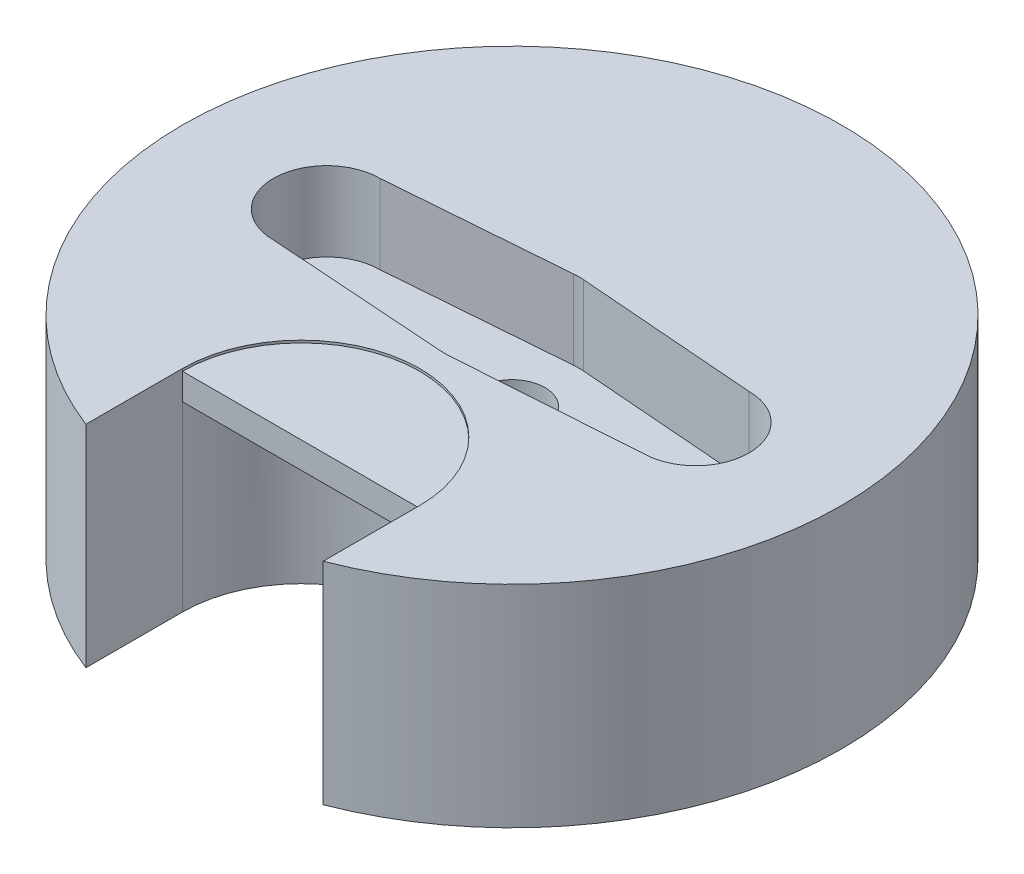
ISO-10303-21;
HEADER;
FILE_DESCRIPTION(('STEP AP214'),'2;1');
FILE_NAME('part.step','',(''),(''),'','','');
FILE_SCHEMA(('AUTOMOTIVE_DESIGN { 1 0 10303 214 1 1 1 1 }'));
ENDSEC;
DATA;
#1=APPLICATION_CONTEXT('core data for automotive mechanical design processes');
#2=APPLICATION_PROTOCOL_DEFINITION('international standard','automotive_design',2000,#1);
#3=PRODUCT_CONTEXT('',#1,'mechanical');
#4=PRODUCT('Part','Part','',(#3));
#5=PRODUCT_RELATED_PRODUCT_CATEGORY('part','',(#4));
#6=PRODUCT_DEFINITION_FORMATION('','',#4);
#7=PRODUCT_DEFINITION_CONTEXT('part definition',#1,'design');
#8=PRODUCT_DEFINITION('design','',#6,#7);
#9=PRODUCT_DEFINITION_SHAPE('','',#8);
#10=(LENGTH_UNIT() NAMED_UNIT(*) SI_UNIT(.MILLI.,.METRE.));
#11=(NAMED_UNIT(*) PLANE_ANGLE_UNIT() SI_UNIT($,.RADIAN.));
#12=(NAMED_UNIT(*) SI_UNIT($,.STERADIAN.) SOLID_ANGLE_UNIT());
#13=UNCERTAINTY_MEASURE_WITH_UNIT(LENGTH_MEASURE(1.E-05),#10,'distance_accuracy_value','');
#14=(GEOMETRIC_REPRESENTATION_CONTEXT(3) GLOBAL_UNCERTAINTY_ASSIGNED_CONTEXT((#13)) GLOBAL_UNIT_ASSIGNED_CONTEXT((#10,
#11,#12)) REPRESENTATION_CONTEXT('',''));
#15=CARTESIAN_POINT('',(0.,0.,0.));
#16=DIRECTION('',(0.,0.,1.));
#17=DIRECTION('',(1.,0.,0.));
#18=AXIS2_PLACEMENT_3D('',#15,#16,#17);
#19=CARTESIAN_POINT('',(0.,5.,8.));
#20=DIRECTION('',(0.,-1.,0.));
#21=DIRECTION('',(0.,0.,-1.));
#22=AXIS2_PLACEMENT_3D('',#19,#20,#21);
#23=CYLINDRICAL_SURFACE('',#22,4.5);
#24=CARTESIAN_POINT('',(0.,7.90862383480316,8.));
#25=DIRECTION('',(0.,-1.,0.));
#26=DIRECTION('',(1.,0.,0.));
#27=AXIS2_PLACEMENT_3D('',#24,#25,#26);
#28=CIRCLE('',#27,4.5);
#29=CARTESIAN_POINT('',(-4.5,7.90862383480316,8.));
#30=VERTEX_POINT('',#29);
#31=CARTESIAN_POINT('',(4.5,7.90862383480316,8.));
#32=VERTEX_POINT('',#31);
#33=EDGE_CURVE('E282',#30,#32,#28,.T.);
#34=ORIENTED_EDGE('',*,*,#33,.T.);
#35=DIRECTION('',(0.,-1.,0.));
#36=VECTOR('',#35,1.);
#37=CARTESIAN_POINT('',(4.5,5.,8.));
#38=LINE('',#37,#36);
#39=CARTESIAN_POINT('',(4.5,8.,8.));
#40=VERTEX_POINT('',#39);
#41=EDGE_CURVE('E149',#40,#32,#38,.T.);
#42=ORIENTED_EDGE('',*,*,#41,.F.);
#43=CARTESIAN_POINT('',(0.,8.,8.));
#44=DIRECTION('',(0.,1.,0.));
#45=DIRECTION('',(0.,0.,1.));
#46=AXIS2_PLACEMENT_3D('',#43,#44,#45);
#47=CIRCLE('',#46,4.5);
#48=CARTESIAN_POINT('',(-4.5,8.,8.));
#49=VERTEX_POINT('',#48);
#50=EDGE_CURVE('E147',#49,#40,#47,.F.);
#51=ORIENTED_EDGE('',*,*,#50,.F.);
#52=DIRECTION('',(0.,-1.,0.));
#53=VECTOR('',#52,1.);
#54=CARTESIAN_POINT('',(-4.5,5.,8.));
#55=LINE('',#54,#53);
#56=EDGE_CURVE('E134',#49,#30,#55,.T.);
#57=ORIENTED_EDGE('',*,*,#56,.T.);
#58=EDGE_LOOP('',(#34,#42,#51,#57));
#59=FACE_BOUND('',#58,.T.);
#60=ADVANCED_FACE('F37',(#59),#23,.F.);
#61=CARTESIAN_POINT('',(4.5,6.9086238348032,8.));
#62=VERTEX_POINT('',#61);
#63=CARTESIAN_POINT('',(4.5,0.,8.));
#64=VERTEX_POINT('',#63);
#65=EDGE_CURVE('E269',#62,#64,#38,.T.);
#66=ORIENTED_EDGE('',*,*,#65,.F.);
#67=CARTESIAN_POINT('',(0.,6.9086238348032,8.));
#68=DIRECTION('',(0.,-0.707106781186551,0.707106781186544));
#69=DIRECTION('',(0.,-0.707106781186544,-0.707106781186551));
#70=AXIS2_PLACEMENT_3D('',#67,#68,#69);
#71=ELLIPSE('',#70,6.36396103067889,4.5);
#72=CARTESIAN_POINT('',(-4.5,6.9086238348032,8.));
#73=VERTEX_POINT('',#72);
#74=EDGE_CURVE('E11',#62,#73,#71,.F.);
#75=ORIENTED_EDGE('',*,*,#74,.T.);
#76=CARTESIAN_POINT('',(-4.5,0.,8.));
#77=VERTEX_POINT('',#76);
#78=EDGE_CURVE('E53',#73,#77,#55,.T.);
#79=ORIENTED_EDGE('',*,*,#78,.T.);
#80=CARTESIAN_POINT('',(0.,0.,8.));
#81=DIRECTION('',(0.,-1.,0.));
#82=DIRECTION('',(0.,0.,1.));
#83=AXIS2_PLACEMENT_3D('',#80,#81,#82);
#84=CIRCLE('',#83,4.5);
#85=EDGE_CURVE('E254',#77,#64,#84,.T.);
#86=ORIENTED_EDGE('',*,*,#85,.T.);
#87=EDGE_LOOP('',(#66,#75,#79,#86));
#88=FACE_BOUND('',#87,.T.);
#89=ADVANCED_FACE('F296',(#88),#23,.F.);
#90=CARTESIAN_POINT('',(4.5,5.,8.));
#91=DIRECTION('',(1.,0.,0.));
#92=DIRECTION('',(0.,0.,-1.));
#93=AXIS2_PLACEMENT_3D('',#90,#91,#92);
#94=PLANE('',#93);
#95=DIRECTION('',(0.,0.,1.));
#96=VECTOR('',#95,1.);
#97=CARTESIAN_POINT('',(4.5,0.,8.));
#98=LINE('',#97,#96);
#99=CARTESIAN_POINT('',(4.5,0.,11.6619037896906));
#100=VERTEX_POINT('',#99);
#101=EDGE_CURVE('E259',#64,#100,#98,.T.);
#102=ORIENTED_EDGE('',*,*,#101,.T.);
#103=DIRECTION('',(0.,-1.,0.));
#104=VECTOR('',#103,1.);
#105=CARTESIAN_POINT('',(4.5,5.,11.6619037896906));
#106=LINE('',#105,#104);
#107=CARTESIAN_POINT('',(4.5,8.,11.6619037896906));
#108=VERTEX_POINT('',#107);
#109=EDGE_CURVE('E266',#108,#100,#106,.T.);
#110=ORIENTED_EDGE('',*,*,#109,.F.);
#111=DIRECTION('',(0.,0.,1.));
#112=VECTOR('',#111,1.);
#113=CARTESIAN_POINT('',(4.5,8.,0.));
#114=LINE('',#113,#112);
#115=EDGE_CURVE('E153',#40,#108,#114,.T.);
#116=ORIENTED_EDGE('',*,*,#115,.F.);
#117=ORIENTED_EDGE('',*,*,#41,.T.);
#118=DIRECTION('',(0.,1.,0.));
#119=VECTOR('',#118,1.);
#120=CARTESIAN_POINT('',(4.5,1.90862383480316,8.));
#121=LINE('',#120,#119);
#122=EDGE_CURVE('E165',#62,#32,#121,.T.);
#123=ORIENTED_EDGE('',*,*,#122,.F.);
#124=ORIENTED_EDGE('',*,*,#65,.T.);
#125=EDGE_LOOP('',(#102,#110,#116,#117,#123,#124));
#126=FACE_BOUND('',#125,.T.);
#127=ADVANCED_FACE('F278',(#126),#94,.F.);
#128=CARTESIAN_POINT('',(0.,5.,0.));
#129=DIRECTION('',(0.,-1.,0.));
#130=DIRECTION('',(0.,0.,-1.));
#131=AXIS2_PLACEMENT_3D('',#128,#129,#130);
#132=CYLINDRICAL_SURFACE('',#131,12.5);
#133=CARTESIAN_POINT('',(0.,0.,0.));
#134=DIRECTION('',(0.,1.,0.));
#135=DIRECTION('',(0.,0.,1.));
#136=AXIS2_PLACEMENT_3D('',#133,#134,#135);
#137=CIRCLE('',#136,12.5);
#138=CARTESIAN_POINT('',(-4.5,0.,11.6619037896906));
#139=VERTEX_POINT('',#138);
#140=EDGE_CURVE('E261',#100,#139,#137,.T.);
#141=ORIENTED_EDGE('',*,*,#140,.T.);
#142=DIRECTION('',(0.,-1.,0.));
#143=VECTOR('',#142,1.);
#144=CARTESIAN_POINT('',(-4.5,5.,11.6619037896906));
#145=LINE('',#144,#143);
#146=CARTESIAN_POINT('',(-4.5,8.,11.6619037896906));
#147=VERTEX_POINT('',#146);
#148=EDGE_CURVE('E144',#147,#139,#145,.T.);
#149=ORIENTED_EDGE('',*,*,#148,.F.);
#150=CARTESIAN_POINT('',(0.,8.,0.));
#151=DIRECTION('',(0.,1.,0.));
#152=DIRECTION('',(0.,0.,1.));
#153=AXIS2_PLACEMENT_3D('',#150,#151,#152);
#154=CIRCLE('',#153,12.5);
#155=EDGE_CURVE('E159',#108,#147,#154,.T.);
#156=ORIENTED_EDGE('',*,*,#155,.F.);
#157=ORIENTED_EDGE('',*,*,#109,.T.);
#158=EDGE_LOOP('',(#141,#149,#156,#157));
#159=FACE_BOUND('',#158,.T.);
#160=ADVANCED_FACE('F305',(#159),#132,.T.);
#161=CARTESIAN_POINT('',(-4.5,5.,8.));
#162=DIRECTION('',(-1.,0.,0.));
#163=DIRECTION('',(0.,0.,1.));
#164=AXIS2_PLACEMENT_3D('',#161,#162,#163);
#165=PLANE('',#164);
#166=DIRECTION('',(0.,0.,-1.));
#167=VECTOR('',#166,1.);
#168=CARTESIAN_POINT('',(-4.5,0.,8.));
#169=LINE('',#168,#167);
#170=EDGE_CURVE('E263',#139,#77,#169,.T.);
#171=ORIENTED_EDGE('',*,*,#170,.T.);
#172=ORIENTED_EDGE('',*,*,#78,.F.);
#173=DIRECTION('',(0.,1.,0.));
#174=VECTOR('',#173,1.);
#175=CARTESIAN_POINT('',(-4.5,1.90862383480316,8.));
#176=LINE('',#175,#174);
#177=EDGE_CURVE('E140',#73,#30,#176,.T.);
#178=ORIENTED_EDGE('',*,*,#177,.T.);
#179=ORIENTED_EDGE('',*,*,#56,.F.);
#180=DIRECTION('',(0.,0.,-1.));
#181=VECTOR('',#180,1.);
#182=CARTESIAN_POINT('',(-4.5,8.,0.));
#183=LINE('',#182,#181);
#184=EDGE_CURVE('E139',#147,#49,#183,.T.);
#185=ORIENTED_EDGE('',*,*,#184,.F.);
#186=ORIENTED_EDGE('',*,*,#148,.T.);
#187=EDGE_LOOP('',(#171,#172,#178,#179,#185,#186));
#188=FACE_BOUND('',#187,.T.);
#189=ADVANCED_FACE('F136',(#188),#165,.F.);
#190=CARTESIAN_POINT('',(0.,5.,8.));
#191=DIRECTION('',(0.,1.,0.));
#192=DIRECTION('',(0.,0.,1.));
#193=AXIS2_PLACEMENT_3D('',#190,#191,#192);
#194=PLANE('',#193);
#195=CARTESIAN_POINT('',(7.,5.,0.0302793333478916));
#196=DIRECTION('',(0.,1.,0.));
#197=DIRECTION('',(0.,0.,1.));
#198=AXIS2_PLACEMENT_3D('',#195,#196,#197);
#199=CIRCLE('',#198,2.02155675811747);
#200=CARTESIAN_POINT('',(7.,5.,-1.99127742476958));
#201=VERTEX_POINT('',#200);
#202=CARTESIAN_POINT('',(7.,5.,2.05183609146536));
#203=VERTEX_POINT('',#202);
#204=EDGE_CURVE('E195',#201,#203,#199,.F.);
#205=ORIENTED_EDGE('',*,*,#204,.F.);
#206=DIRECTION('',(-0.996955541405773,0.,-0.0779721005252608));
#207=VECTOR('',#206,1.);
#208=CARTESIAN_POINT('',(0.197348927686564,5.,-2.52331418189595));
#209=LINE('',#208,#207);
#210=CARTESIAN_POINT('',(0.197348927686564,5.,-2.52331418189595));
#211=VERTEX_POINT('',#210);
#212=EDGE_CURVE('E193',#201,#211,#209,.T.);
#213=ORIENTED_EDGE('',*,*,#212,.T.);
#214=CARTESIAN_POINT('',(0.,5.,0.));
#215=DIRECTION('',(0.,1.,0.));
#216=DIRECTION('',(0.,0.,1.));
#217=AXIS2_PLACEMENT_3D('',#214,#215,#216);
#218=CIRCLE('',#217,2.53101976677707);
#219=CARTESIAN_POINT('',(-0.197348927686564,5.,-2.52331418189595));
#220=VERTEX_POINT('',#219);
#221=EDGE_CURVE('E160',#211,#220,#218,.T.);
#222=ORIENTED_EDGE('',*,*,#221,.T.);
#223=DIRECTION('',(0.996955541405773,0.,-0.0779721005252608));
#224=VECTOR('',#223,1.);
#225=CARTESIAN_POINT('',(-0.197348927686564,5.,-2.52331418189595));
#226=LINE('',#225,#224);
#227=CARTESIAN_POINT('',(-7.,5.,-1.99127742476958));
#228=VERTEX_POINT('',#227);
#229=EDGE_CURVE('E162',#228,#220,#226,.T.);
#230=ORIENTED_EDGE('',*,*,#229,.F.);
#231=CARTESIAN_POINT('',(-7.,5.,0.0302793333478916));
#232=DIRECTION('',(0.,1.,0.));
#233=DIRECTION('',(0.,0.,1.));
#234=AXIS2_PLACEMENT_3D('',#231,#232,#233);
#235=CIRCLE('',#234,2.02155675811747);
#236=CARTESIAN_POINT('',(-7.,5.,2.05183609146536));
#237=VERTEX_POINT('',#236);
#238=EDGE_CURVE('E205',#228,#237,#235,.T.);
#239=ORIENTED_EDGE('',*,*,#238,.T.);
#240=DIRECTION('',(0.997605816807268,0.,0.0691565923994485));
#241=VECTOR('',#240,1.);
#242=CARTESIAN_POINT('',(-0.175036702365949,5.,2.52496004179098));
#243=LINE('',#242,#241);
#244=CARTESIAN_POINT('',(-0.175036702365949,5.,2.52496004179098));
#245=VERTEX_POINT('',#244);
#246=EDGE_CURVE('E203',#237,#245,#243,.T.);
#247=ORIENTED_EDGE('',*,*,#246,.T.);
#248=CARTESIAN_POINT('',(0.,5.,0.));
#249=DIRECTION('',(0.,1.,0.));
#250=DIRECTION('',(0.,0.,1.));
#251=AXIS2_PLACEMENT_3D('',#248,#249,#250);
#252=CIRCLE('',#251,2.53101976677707);
#253=CARTESIAN_POINT('',(0.17503670236595,5.,2.52496004179098));
#254=VERTEX_POINT('',#253);
#255=EDGE_CURVE('E201',#245,#254,#252,.T.);
#256=ORIENTED_EDGE('',*,*,#255,.T.);
#257=DIRECTION('',(-0.997605816807268,0.,0.0691565923994486));
#258=VECTOR('',#257,1.);
#259=CARTESIAN_POINT('',(0.175036702365949,5.,2.52496004179098));
#260=LINE('',#259,#258);
#261=EDGE_CURVE('E198',#203,#254,#260,.T.);
#262=ORIENTED_EDGE('',*,*,#261,.F.);
#263=EDGE_LOOP('',(#205,#213,#222,#230,#239,#247,#256,#262));
#264=FACE_BOUND('',#263,.T.);
#265=CARTESIAN_POINT('',(6.44999410206563,5.,-0.00872257523042366));
#266=DIRECTION('',(0.,1.,0.));
#267=DIRECTION('',(0.,0.,1.));
#268=AXIS2_PLACEMENT_3D('',#265,#266,#267);
#269=CIRCLE('',#268,0.600000000000014);
#270=CARTESIAN_POINT('',(6.44999410206563,5.,0.59127742476959));
#271=VERTEX_POINT('',#270);
#272=EDGE_CURVE('E237',#271,#271,#269,.T.);
#273=ORIENTED_EDGE('',*,*,#272,.F.);
#274=EDGE_LOOP('',(#273));
#275=FACE_BOUND('',#274,.T.);
#276=CARTESIAN_POINT('',(-6.44999410206563,5.,0.00872257523042383));
#277=DIRECTION('',(0.,1.,0.));
#278=DIRECTION('',(0.,0.,1.));
#279=AXIS2_PLACEMENT_3D('',#276,#277,#278);
#280=CIRCLE('',#279,0.600000000000013);
#281=CARTESIAN_POINT('',(-6.44999410206563,5.,0.608722575230437));
#282=VERTEX_POINT('',#281);
#283=EDGE_CURVE('E232',#282,#282,#280,.T.);
#284=ORIENTED_EDGE('',*,*,#283,.F.);
#285=EDGE_LOOP('',(#284));
#286=FACE_BOUND('',#285,.T.);
#287=CARTESIAN_POINT('',(0.,5.,0.));
#288=DIRECTION('',(0.,-1.,0.));
#289=DIRECTION('',(0.,0.,-1.));
#290=AXIS2_PLACEMENT_3D('',#287,#288,#289);
#291=CIRCLE('',#290,1.25);
#292=CARTESIAN_POINT('',(0.,5.,-1.25));
#293=VERTEX_POINT('',#292);
#294=EDGE_CURVE('E245',#293,#293,#291,.T.);
#295=ORIENTED_EDGE('',*,*,#294,.T.);
#296=EDGE_LOOP('',(#295));
#297=FACE_BOUND('',#296,.T.);
#298=ADVANCED_FACE('F311',(#264,#275,#286,#297),#194,.T.);
#299=CARTESIAN_POINT('',(0.,0.,8.));
#300=DIRECTION('',(0.,1.,0.));
#301=DIRECTION('',(0.,0.,1.));
#302=AXIS2_PLACEMENT_3D('',#299,#300,#301);
#303=PLANE('',#302);
#304=CARTESIAN_POINT('',(0.,0.,0.));
#305=DIRECTION('',(0.,1.,0.));
#306=DIRECTION('',(0.,0.,1.));
#307=AXIS2_PLACEMENT_3D('',#304,#305,#306);
#308=CIRCLE('',#307,2.5);
#309=CARTESIAN_POINT('',(0.,0.,2.5));
#310=VERTEX_POINT('',#309);
#311=EDGE_CURVE('E248',#310,#310,#308,.T.);
#312=ORIENTED_EDGE('',*,*,#311,.T.);
#313=EDGE_LOOP('',(#312));
#314=FACE_BOUND('',#313,.T.);
#315=ORIENTED_EDGE('',*,*,#85,.F.);
#316=ORIENTED_EDGE('',*,*,#170,.F.);
#317=ORIENTED_EDGE('',*,*,#140,.F.);
#318=ORIENTED_EDGE('',*,*,#101,.F.);
#319=EDGE_LOOP('',(#315,#316,#317,#318));
#320=FACE_BOUND('',#319,.T.);
#321=ADVANCED_FACE('F312',(#314,#320),#303,.F.);
#322=CARTESIAN_POINT('',(0.,2.5,0.));
#323=DIRECTION('',(0.,-1.,0.));
#324=DIRECTION('',(0.,0.,-1.));
#325=AXIS2_PLACEMENT_3D('',#322,#323,#324);
#326=CYLINDRICAL_SURFACE('',#325,2.5);
#327=CARTESIAN_POINT('',(0.,2.5,0.));
#328=DIRECTION('',(0.,1.,0.));
#329=DIRECTION('',(0.,0.,1.));
#330=AXIS2_PLACEMENT_3D('',#327,#328,#329);
#331=CIRCLE('',#330,2.5);
#332=CARTESIAN_POINT('',(0.,2.5,2.5));
#333=VERTEX_POINT('',#332);
#334=EDGE_CURVE('E251',#333,#333,#331,.T.);
#335=ORIENTED_EDGE('',*,*,#334,.T.);
#336=EDGE_LOOP('',(#335));
#337=FACE_BOUND('',#336,.T.);
#338=ORIENTED_EDGE('',*,*,#311,.F.);
#339=EDGE_LOOP('',(#338));
#340=FACE_BOUND('',#339,.T.);
#341=ADVANCED_FACE('F315',(#337,#340),#326,.F.);
#342=CARTESIAN_POINT('',(0.,2.5,0.));
#343=DIRECTION('',(0.,1.,0.));
#344=DIRECTION('',(0.,0.,1.));
#345=AXIS2_PLACEMENT_3D('',#342,#343,#344);
#346=PLANE('',#345);
#347=CARTESIAN_POINT('',(0.,2.5,0.));
#348=DIRECTION('',(0.,-1.,0.));
#349=DIRECTION('',(0.,0.,-1.));
#350=AXIS2_PLACEMENT_3D('',#347,#348,#349);
#351=CIRCLE('',#350,1.25);
#352=CARTESIAN_POINT('',(0.,2.5,-1.25));
#353=VERTEX_POINT('',#352);
#354=EDGE_CURVE('E236',#353,#353,#351,.T.);
#355=ORIENTED_EDGE('',*,*,#354,.F.);
#356=EDGE_LOOP('',(#355));
#357=FACE_BOUND('',#356,.T.);
#358=ORIENTED_EDGE('',*,*,#334,.F.);
#359=EDGE_LOOP('',(#358));
#360=FACE_BOUND('',#359,.T.);
#361=ADVANCED_FACE('F322',(#357,#360),#346,.F.);
#362=CARTESIAN_POINT('',(0.,5.,0.));
#363=DIRECTION('',(0.,-1.,0.));
#364=DIRECTION('',(0.,0.,-1.));
#365=AXIS2_PLACEMENT_3D('',#362,#363,#364);
#366=CYLINDRICAL_SURFACE('',#365,1.25);
#367=ORIENTED_EDGE('',*,*,#294,.F.);
#368=EDGE_LOOP('',(#367));
#369=FACE_BOUND('',#368,.T.);
#370=ORIENTED_EDGE('',*,*,#354,.T.);
#371=EDGE_LOOP('',(#370));
#372=FACE_BOUND('',#371,.T.);
#373=ADVANCED_FACE('F326',(#369,#372),#366,.F.);
#374=CARTESIAN_POINT('',(-6.44999410206563,2.5,0.00872257523042383));
#375=DIRECTION('',(0.,1.,0.));
#376=DIRECTION('',(0.,0.,1.));
#377=AXIS2_PLACEMENT_3D('',#374,#375,#376);
#378=CYLINDRICAL_SURFACE('',#377,0.600000000000013);
#379=CARTESIAN_POINT('',(-6.44999410206563,2.5,0.00872257523042383));
#380=DIRECTION('',(0.,1.,0.));
#381=DIRECTION('',(0.,0.,1.));
#382=AXIS2_PLACEMENT_3D('',#379,#380,#381);
#383=CIRCLE('',#382,0.600000000000013);
#384=CARTESIAN_POINT('',(-6.44999410206563,2.5,0.608722575230437));
#385=VERTEX_POINT('',#384);
#386=EDGE_CURVE('E240',#385,#385,#383,.T.);
#387=ORIENTED_EDGE('',*,*,#386,.F.);
#388=EDGE_LOOP('',(#387));
#389=FACE_BOUND('',#388,.T.);
#390=ORIENTED_EDGE('',*,*,#283,.T.);
#391=EDGE_LOOP('',(#390));
#392=FACE_BOUND('',#391,.T.);
#393=ADVANCED_FACE('F330',(#389,#392),#378,.F.);
#394=CARTESIAN_POINT('',(-6.44999410206563,2.5,0.00872257523042383));
#395=DIRECTION('',(0.,1.,0.));
#396=DIRECTION('',(0.,0.,1.));
#397=AXIS2_PLACEMENT_3D('',#394,#395,#396);
#398=PLANE('',#397);
#399=ORIENTED_EDGE('',*,*,#386,.T.);
#400=EDGE_LOOP('',(#399));
#401=FACE_BOUND('',#400,.T.);
#402=ADVANCED_FACE('F334',(#401),#398,.T.);
#403=CARTESIAN_POINT('',(6.44999410206563,2.5,-0.00872257523042366));
#404=DIRECTION('',(0.,1.,0.));
#405=DIRECTION('',(0.,0.,1.));
#406=AXIS2_PLACEMENT_3D('',#403,#404,#405);
#407=CYLINDRICAL_SURFACE('',#406,0.600000000000014);
#408=CARTESIAN_POINT('',(6.44999410206563,2.5,-0.00872257523042366));
#409=DIRECTION('',(0.,1.,0.));
#410=DIRECTION('',(0.,0.,1.));
#411=AXIS2_PLACEMENT_3D('',#408,#409,#410);
#412=CIRCLE('',#411,0.600000000000014);
#413=CARTESIAN_POINT('',(6.44999410206563,2.5,0.59127742476959));
#414=VERTEX_POINT('',#413);
#415=EDGE_CURVE('E233',#414,#414,#412,.T.);
#416=ORIENTED_EDGE('',*,*,#415,.F.);
#417=EDGE_LOOP('',(#416));
#418=FACE_BOUND('',#417,.T.);
#419=ORIENTED_EDGE('',*,*,#272,.T.);
#420=EDGE_LOOP('',(#419));
#421=FACE_BOUND('',#420,.T.);
#422=ADVANCED_FACE('F338',(#418,#421),#407,.F.);
#423=CARTESIAN_POINT('',(6.44999410206563,2.5,-0.00872257523042366));
#424=DIRECTION('',(0.,1.,0.));
#425=DIRECTION('',(0.,0.,1.));
#426=AXIS2_PLACEMENT_3D('',#423,#424,#425);
#427=PLANE('',#426);
#428=ORIENTED_EDGE('',*,*,#415,.T.);
#429=EDGE_LOOP('',(#428));
#430=FACE_BOUND('',#429,.T.);
#431=ADVANCED_FACE('F342',(#430),#427,.T.);
#432=CARTESIAN_POINT('',(0.197348927686564,8.,-2.52331418189595));
#433=DIRECTION('',(-0.0779721005252608,0.,0.996955541405773));
#434=DIRECTION('',(0.996955541405773,0.,0.0779721005252608));
#435=AXIS2_PLACEMENT_3D('',#432,#433,#434);
#436=PLANE('',#435);
#437=ORIENTED_EDGE('',*,*,#212,.F.);
#438=DIRECTION('',(0.,-1.,0.));
#439=VECTOR('',#438,1.);
#440=CARTESIAN_POINT('',(7.,8.,-1.99127742476958));
#441=LINE('',#440,#439);
#442=CARTESIAN_POINT('',(7.,8.,-1.99127742476958));
#443=VERTEX_POINT('',#442);
#444=EDGE_CURVE('E229',#443,#201,#441,.T.);
#445=ORIENTED_EDGE('',*,*,#444,.F.);
#446=DIRECTION('',(-0.996955541405773,0.,-0.0779721005252608));
#447=VECTOR('',#446,1.);
#448=CARTESIAN_POINT('',(0.197348927686564,8.,-2.52331418189595));
#449=LINE('',#448,#447);
#450=CARTESIAN_POINT('',(0.197348927686564,8.,-2.52331418189595));
#451=VERTEX_POINT('',#450);
#452=EDGE_CURVE('E170',#443,#451,#449,.T.);
#453=ORIENTED_EDGE('',*,*,#452,.T.);
#454=DIRECTION('',(0.,-1.,0.));
#455=VECTOR('',#454,1.);
#456=CARTESIAN_POINT('',(0.197348927686564,8.,-2.52331418189595));
#457=LINE('',#456,#455);
#458=EDGE_CURVE('E192',#451,#211,#457,.T.);
#459=ORIENTED_EDGE('',*,*,#458,.T.);
#460=EDGE_LOOP('',(#437,#445,#453,#459));
#461=FACE_BOUND('',#460,.T.);
#462=ADVANCED_FACE('F346',(#461),#436,.T.);
#463=CARTESIAN_POINT('',(7.,8.,0.0302793333478916));
#464=DIRECTION('',(0.,-1.,0.));
#465=DIRECTION('',(0.,0.,-1.));
#466=AXIS2_PLACEMENT_3D('',#463,#464,#465);
#467=CYLINDRICAL_SURFACE('',#466,2.02155675811747);
#468=ORIENTED_EDGE('',*,*,#204,.T.);
#469=DIRECTION('',(0.,-1.,0.));
#470=VECTOR('',#469,1.);
#471=CARTESIAN_POINT('',(7.,8.,2.05183609146536));
#472=LINE('',#471,#470);
#473=CARTESIAN_POINT('',(7.,8.,2.05183609146536));
#474=VERTEX_POINT('',#473);
#475=EDGE_CURVE('E226',#474,#203,#472,.T.);
#476=ORIENTED_EDGE('',*,*,#475,.F.);
#477=CARTESIAN_POINT('',(7.,8.,0.0302793333478916));
#478=DIRECTION('',(0.,1.,0.));
#479=DIRECTION('',(0.,0.,1.));
#480=AXIS2_PLACEMENT_3D('',#477,#478,#479);
#481=CIRCLE('',#480,2.02155675811747);
#482=EDGE_CURVE('E173',#443,#474,#481,.F.);
#483=ORIENTED_EDGE('',*,*,#482,.F.);
#484=ORIENTED_EDGE('',*,*,#444,.T.);
#485=EDGE_LOOP('',(#468,#476,#483,#484));
#486=FACE_BOUND('',#485,.T.);
#487=ADVANCED_FACE('F350',(#486),#467,.F.);
#488=CARTESIAN_POINT('',(0.175036702365949,8.,2.52496004179098));
#489=DIRECTION('',(0.0691565923994486,0.,0.997605816807268));
#490=DIRECTION('',(0.997605816807268,0.,-0.0691565923994486));
#491=AXIS2_PLACEMENT_3D('',#488,#489,#490);
#492=PLANE('',#491);
#493=ORIENTED_EDGE('',*,*,#261,.T.);
#494=DIRECTION('',(0.,-1.,0.));
#495=VECTOR('',#494,1.);
#496=CARTESIAN_POINT('',(0.17503670236595,8.,2.52496004179098));
#497=LINE('',#496,#495);
#498=CARTESIAN_POINT('',(0.17503670236595,8.,2.52496004179098));
#499=VERTEX_POINT('',#498);
#500=EDGE_CURVE('E223',#499,#254,#497,.T.);
#501=ORIENTED_EDGE('',*,*,#500,.F.);
#502=DIRECTION('',(-0.997605816807268,0.,0.0691565923994486));
#503=VECTOR('',#502,1.);
#504=CARTESIAN_POINT('',(0.175036702365949,8.,2.52496004179098));
#505=LINE('',#504,#503);
#506=EDGE_CURVE('E176',#474,#499,#505,.T.);
#507=ORIENTED_EDGE('',*,*,#506,.F.);
#508=ORIENTED_EDGE('',*,*,#475,.T.);
#509=EDGE_LOOP('',(#493,#501,#507,#508));
#510=FACE_BOUND('',#509,.T.);
#511=ADVANCED_FACE('F354',(#510),#492,.F.);
#512=CARTESIAN_POINT('',(0.,8.,0.));
#513=DIRECTION('',(0.,-1.,0.));
#514=DIRECTION('',(0.,0.,-1.));
#515=AXIS2_PLACEMENT_3D('',#512,#513,#514);
#516=CYLINDRICAL_SURFACE('',#515,2.53101976677707);
#517=ORIENTED_EDGE('',*,*,#255,.F.);
#518=DIRECTION('',(0.,-1.,0.));
#519=VECTOR('',#518,1.);
#520=CARTESIAN_POINT('',(-0.175036702365949,8.,2.52496004179098));
#521=LINE('',#520,#519);
#522=CARTESIAN_POINT('',(-0.175036702365949,8.,2.52496004179098));
#523=VERTEX_POINT('',#522);
#524=EDGE_CURVE('E220',#523,#245,#521,.T.);
#525=ORIENTED_EDGE('',*,*,#524,.F.);
#526=CARTESIAN_POINT('',(0.,8.,0.));
#527=DIRECTION('',(0.,1.,0.));
#528=DIRECTION('',(0.,0.,1.));
#529=AXIS2_PLACEMENT_3D('',#526,#527,#528);
#530=CIRCLE('',#529,2.53101976677707);
#531=EDGE_CURVE('E178',#523,#499,#530,.T.);
#532=ORIENTED_EDGE('',*,*,#531,.T.);
#533=ORIENTED_EDGE('',*,*,#500,.T.);
#534=EDGE_LOOP('',(#517,#525,#532,#533));
#535=FACE_BOUND('',#534,.T.);
#536=ADVANCED_FACE('F358',(#535),#516,.F.);
#537=CARTESIAN_POINT('',(-0.175036702365949,8.,2.52496004179098));
#538=DIRECTION('',(0.0691565923994485,0.,-0.997605816807268));
#539=DIRECTION('',(-0.997605816807268,0.,-0.0691565923994485));
#540=AXIS2_PLACEMENT_3D('',#537,#538,#539);
#541=PLANE('',#540);
#542=ORIENTED_EDGE('',*,*,#246,.F.);
#543=DIRECTION('',(0.,-1.,0.));
#544=VECTOR('',#543,1.);
#545=CARTESIAN_POINT('',(-7.,8.,2.05183609146536));
#546=LINE('',#545,#544);
#547=CARTESIAN_POINT('',(-7.,8.,2.05183609146536));
#548=VERTEX_POINT('',#547);
#549=EDGE_CURVE('E217',#548,#237,#546,.T.);
#550=ORIENTED_EDGE('',*,*,#549,.F.);
#551=DIRECTION('',(0.997605816807268,0.,0.0691565923994485));
#552=VECTOR('',#551,1.);
#553=CARTESIAN_POINT('',(-0.175036702365949,8.,2.52496004179098));
#554=LINE('',#553,#552);
#555=EDGE_CURVE('E181',#548,#523,#554,.T.);
#556=ORIENTED_EDGE('',*,*,#555,.T.);
#557=ORIENTED_EDGE('',*,*,#524,.T.);
#558=EDGE_LOOP('',(#542,#550,#556,#557));
#559=FACE_BOUND('',#558,.T.);
#560=ADVANCED_FACE('F362',(#559),#541,.T.);
#561=CARTESIAN_POINT('',(-7.,8.,0.0302793333478916));
#562=DIRECTION('',(0.,-1.,0.));
#563=DIRECTION('',(0.,0.,-1.));
#564=AXIS2_PLACEMENT_3D('',#561,#562,#563);
#565=CYLINDRICAL_SURFACE('',#564,2.02155675811747);
#566=ORIENTED_EDGE('',*,*,#238,.F.);
#567=DIRECTION('',(0.,-1.,0.));
#568=VECTOR('',#567,1.);
#569=CARTESIAN_POINT('',(-7.,8.,-1.99127742476958));
#570=LINE('',#569,#568);
#571=CARTESIAN_POINT('',(-7.,8.,-1.99127742476958));
#572=VERTEX_POINT('',#571);
#573=EDGE_CURVE('E214',#572,#228,#570,.T.);
#574=ORIENTED_EDGE('',*,*,#573,.F.);
#575=CARTESIAN_POINT('',(-7.,8.,0.0302793333478916));
#576=DIRECTION('',(0.,1.,0.));
#577=DIRECTION('',(0.,0.,1.));
#578=AXIS2_PLACEMENT_3D('',#575,#576,#577);
#579=CIRCLE('',#578,2.02155675811747);
#580=EDGE_CURVE('E184',#572,#548,#579,.T.);
#581=ORIENTED_EDGE('',*,*,#580,.T.);
#582=ORIENTED_EDGE('',*,*,#549,.T.);
#583=EDGE_LOOP('',(#566,#574,#581,#582));
#584=FACE_BOUND('',#583,.T.);
#585=ADVANCED_FACE('F366',(#584),#565,.F.);
#586=CARTESIAN_POINT('',(-0.197348927686564,8.,-2.52331418189595));
#587=DIRECTION('',(-0.0779721005252608,0.,-0.996955541405773));
#588=DIRECTION('',(-0.996955541405773,0.,0.0779721005252608));
#589=AXIS2_PLACEMENT_3D('',#586,#587,#588);
#590=PLANE('',#589);
#591=ORIENTED_EDGE('',*,*,#229,.T.);
#592=DIRECTION('',(0.,-1.,0.));
#593=VECTOR('',#592,1.);
#594=CARTESIAN_POINT('',(-0.197348927686564,8.,-2.52331418189595));
#595=LINE('',#594,#593);
#596=CARTESIAN_POINT('',(-0.197348927686564,8.,-2.52331418189595));
#597=VERTEX_POINT('',#596);
#598=EDGE_CURVE('E211',#597,#220,#595,.T.);
#599=ORIENTED_EDGE('',*,*,#598,.F.);
#600=DIRECTION('',(0.996955541405773,0.,-0.0779721005252608));
#601=VECTOR('',#600,1.);
#602=CARTESIAN_POINT('',(-0.197348927686564,8.,-2.52331418189595));
#603=LINE('',#602,#601);
#604=EDGE_CURVE('E187',#572,#597,#603,.T.);
#605=ORIENTED_EDGE('',*,*,#604,.F.);
#606=ORIENTED_EDGE('',*,*,#573,.T.);
#607=EDGE_LOOP('',(#591,#599,#605,#606));
#608=FACE_BOUND('',#607,.T.);
#609=ADVANCED_FACE('F370',(#608),#590,.F.);
#610=CARTESIAN_POINT('',(0.,8.,0.));
#611=DIRECTION('',(0.,-1.,0.));
#612=DIRECTION('',(0.,0.,-1.));
#613=AXIS2_PLACEMENT_3D('',#610,#611,#612);
#614=CYLINDRICAL_SURFACE('',#613,2.53101976677707);
#615=ORIENTED_EDGE('',*,*,#221,.F.);
#616=ORIENTED_EDGE('',*,*,#458,.F.);
#617=CARTESIAN_POINT('',(0.,8.,0.));
#618=DIRECTION('',(0.,1.,0.));
#619=DIRECTION('',(0.,0.,1.));
#620=AXIS2_PLACEMENT_3D('',#617,#618,#619);
#621=CIRCLE('',#620,2.53101976677707);
#622=EDGE_CURVE('E189',#451,#597,#621,.T.);
#623=ORIENTED_EDGE('',*,*,#622,.T.);
#624=ORIENTED_EDGE('',*,*,#598,.T.);
#625=EDGE_LOOP('',(#615,#616,#623,#624));
#626=FACE_BOUND('',#625,.T.);
#627=ADVANCED_FACE('F374',(#626),#614,.F.);
#628=CARTESIAN_POINT('',(0.,8.,0.));
#629=DIRECTION('',(0.,1.,0.));
#630=DIRECTION('',(0.,0.,1.));
#631=AXIS2_PLACEMENT_3D('',#628,#629,#630);
#632=PLANE('',#631);
#633=ORIENTED_EDGE('',*,*,#184,.T.);
#634=ORIENTED_EDGE('',*,*,#50,.T.);
#635=ORIENTED_EDGE('',*,*,#115,.T.);
#636=ORIENTED_EDGE('',*,*,#155,.T.);
#637=EDGE_LOOP('',(#633,#634,#635,#636));
#638=FACE_BOUND('',#637,.T.);
#639=ORIENTED_EDGE('',*,*,#452,.F.);
#640=ORIENTED_EDGE('',*,*,#482,.T.);
#641=ORIENTED_EDGE('',*,*,#506,.T.);
#642=ORIENTED_EDGE('',*,*,#531,.F.);
#643=ORIENTED_EDGE('',*,*,#555,.F.);
#644=ORIENTED_EDGE('',*,*,#580,.F.);
#645=ORIENTED_EDGE('',*,*,#604,.T.);
#646=ORIENTED_EDGE('',*,*,#622,.F.);
#647=EDGE_LOOP('',(#639,#640,#641,#642,#643,#644,#645,#646));
#648=FACE_BOUND('',#647,.T.);
#649=ADVANCED_FACE('F156',(#638,#648),#632,.T.);
#650=CARTESIAN_POINT('',(-4.5,1.90862383480316,8.));
#651=DIRECTION('',(0.,0.,-1.));
#652=DIRECTION('',(0.,1.,0.));
#653=AXIS2_PLACEMENT_3D('',#650,#651,#652);
#654=PLANE('',#653);
#655=ORIENTED_EDGE('',*,*,#177,.F.);
#656=DIRECTION('',(1.,0.,0.));
#657=VECTOR('',#656,1.);
#658=CARTESIAN_POINT('',(4.5,6.9086238348032,8.));
#659=LINE('',#658,#657);
#660=EDGE_CURVE('E47',#73,#62,#659,.T.);
#661=ORIENTED_EDGE('',*,*,#660,.T.);
#662=ORIENTED_EDGE('',*,*,#122,.T.);
#663=DIRECTION('',(-1.,0.,0.));
#664=VECTOR('',#663,1.);
#665=CARTESIAN_POINT('',(-4.5,7.90862383480316,8.));
#666=LINE('',#665,#664);
#667=EDGE_CURVE('E281',#32,#30,#666,.T.);
#668=ORIENTED_EDGE('',*,*,#667,.T.);
#669=EDGE_LOOP('',(#655,#661,#662,#668));
#670=FACE_BOUND('',#669,.T.);
#671=ADVANCED_FACE('F274',(#670),#654,.F.);
#672=CARTESIAN_POINT('',(0.,7.90862383480316,8.));
#673=DIRECTION('',(0.,-1.,0.));
#674=DIRECTION('',(1.,0.,0.));
#675=AXIS2_PLACEMENT_3D('',#672,#673,#674);
#676=PLANE('',#675);
#677=ORIENTED_EDGE('',*,*,#33,.F.);
#678=ORIENTED_EDGE('',*,*,#667,.F.);
#679=EDGE_LOOP('',(#677,#678));
#680=FACE_BOUND('',#679,.T.);
#681=ADVANCED_FACE('F287',(#680),#676,.F.);
#682=CARTESIAN_POINT('',(0.,1.90862383480316,2.99999999999991));
#683=DIRECTION('',(0.,-0.707106781186551,0.707106781186544));
#684=DIRECTION('',(1.,0.,0.));
#685=AXIS2_PLACEMENT_3D('',#682,#683,#684);
#686=PLANE('',#685);
#687=ORIENTED_EDGE('',*,*,#74,.F.);
#688=ORIENTED_EDGE('',*,*,#660,.F.);
#689=EDGE_LOOP('',(#687,#688));
#690=FACE_BOUND('',#689,.T.);
#691=ADVANCED_FACE('F40',(#690),#686,.T.);
#692=CLOSED_SHELL('',(#60,#89,#127,#160,#189,#298,#321,#341,#361,#373,#393,#402,#422,#431,#462,
#487,#511,#536,#560,#585,#609,#627,#649,#671,#681,#691));
#693=MANIFOLD_SOLID_BREP('B2',#692);
#694=ADVANCED_BREP_SHAPE_REPRESENTATION('',(#18,#693),#14);
#695=SHAPE_DEFINITION_REPRESENTATION(#9,#694);
ENDSEC;
END-ISO-10303-21;
